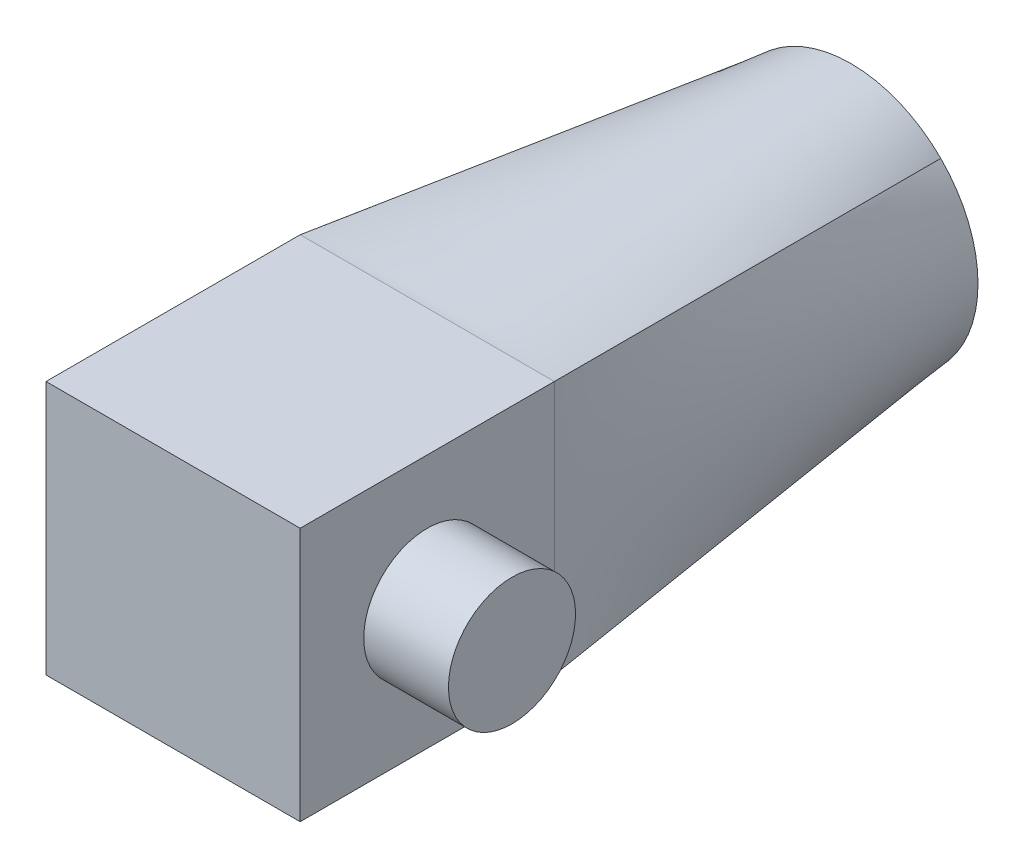
ISO-10303-21;
HEADER;
FILE_DESCRIPTION(('STEP AP214'),'2;1');
FILE_NAME('part.step','',(''),(''),'','','');
FILE_SCHEMA(('AUTOMOTIVE_DESIGN { 1 0 10303 214 1 1 1 1 }'));
ENDSEC;
DATA;
#1=APPLICATION_CONTEXT('core data for automotive mechanical design processes');
#2=APPLICATION_PROTOCOL_DEFINITION('international standard','automotive_design',2000,#1);
#3=PRODUCT_CONTEXT('',#1,'mechanical');
#4=PRODUCT('Part','Part','',(#3));
#5=PRODUCT_RELATED_PRODUCT_CATEGORY('part','',(#4));
#6=PRODUCT_DEFINITION_FORMATION('','',#4);
#7=PRODUCT_DEFINITION_CONTEXT('part definition',#1,'design');
#8=PRODUCT_DEFINITION('design','',#6,#7);
#9=PRODUCT_DEFINITION_SHAPE('','',#8);
#10=(LENGTH_UNIT() NAMED_UNIT(*) SI_UNIT(.MILLI.,.METRE.));
#11=(NAMED_UNIT(*) PLANE_ANGLE_UNIT() SI_UNIT($,.RADIAN.));
#12=(NAMED_UNIT(*) SI_UNIT($,.STERADIAN.) SOLID_ANGLE_UNIT());
#13=UNCERTAINTY_MEASURE_WITH_UNIT(LENGTH_MEASURE(1.E-05),#10,'distance_accuracy_value','');
#14=(GEOMETRIC_REPRESENTATION_CONTEXT(3) GLOBAL_UNCERTAINTY_ASSIGNED_CONTEXT((#13)) GLOBAL_UNIT_ASSIGNED_CONTEXT((#10,
#11,#12)) REPRESENTATION_CONTEXT('',''));
#15=CARTESIAN_POINT('',(0.,0.,0.));
#16=DIRECTION('',(0.,0.,1.));
#17=DIRECTION('',(1.,0.,0.));
#18=AXIS2_PLACEMENT_3D('',#15,#16,#17);
#19=CARTESIAN_POINT('',(0.,0.,0.));
#20=DIRECTION('',(0.,0.,1.));
#21=DIRECTION('',(1.,0.,0.));
#22=AXIS2_PLACEMENT_3D('',#19,#20,#21);
#23=PLANE('',#22);
#24=CARTESIAN_POINT('',(0.,0.,0.));
#25=DIRECTION('',(0.,0.,1.));
#26=DIRECTION('',(1.,0.,0.));
#27=AXIS2_PLACEMENT_3D('',#24,#25,#26);
#28=CIRCLE('',#27,0.75);
#29=CARTESIAN_POINT('',(0.75,0.,0.));
#30=VERTEX_POINT('',#29);
#31=EDGE_CURVE('E159',#30,#30,#28,.T.);
#32=ORIENTED_EDGE('',*,*,#31,.T.);
#33=EDGE_LOOP('',(#32));
#34=FACE_BOUND('',#33,.T.);
#35=CARTESIAN_POINT('',(0.,0.,0.));
#36=DIRECTION('',(0.,0.,1.));
#37=DIRECTION('',(1.,0.,0.));
#38=AXIS2_PLACEMENT_3D('',#35,#36,#37);
#39=CIRCLE('',#38,1.5);
#40=CARTESIAN_POINT('',(-1.06066017177982,1.06066017177982,0.));
#41=VERTEX_POINT('',#40);
#42=CARTESIAN_POINT('',(-1.06066017177982,-1.06066017177982,0.));
#43=VERTEX_POINT('',#42);
#44=EDGE_CURVE('E247',#41,#43,#39,.T.);
#45=ORIENTED_EDGE('',*,*,#44,.F.);
#46=CARTESIAN_POINT('',(1.06066017177982,1.06066017177982,0.));
#47=VERTEX_POINT('',#46);
#48=EDGE_CURVE('E237',#47,#41,#39,.T.);
#49=ORIENTED_EDGE('',*,*,#48,.F.);
#50=CARTESIAN_POINT('',(1.06066017177982,-1.06066017177982,0.));
#51=VERTEX_POINT('',#50);
#52=EDGE_CURVE('E227',#51,#47,#39,.T.);
#53=ORIENTED_EDGE('',*,*,#52,.F.);
#54=EDGE_CURVE('E236',#43,#51,#39,.T.);
#55=ORIENTED_EDGE('',*,*,#54,.F.);
#56=EDGE_LOOP('',(#45,#49,#53,#55));
#57=FACE_BOUND('',#56,.T.);
#58=ADVANCED_FACE('F69',(#34,#57),#23,.F.);
#59=CARTESIAN_POINT('',(1.06066017177982,-1.06066017177982,0.));
#60=CARTESIAN_POINT('',(1.5,-1.5,5.));
#61=CARTESIAN_POINT('',(1.18566017177982,-0.935660171779822,0.));
#62=CARTESIAN_POINT('',(1.5,-1.25,5.));
#63=CARTESIAN_POINT('',(1.29773789431569,-0.778019163644887,0.));
#64=CARTESIAN_POINT('',(1.5,-0.999999999999999,5.));
#65=CARTESIAN_POINT('',(1.45548773968208,-0.413512878852326,0.));
#66=CARTESIAN_POINT('',(1.5,-0.499999999999999,5.));
#67=CARTESIAN_POINT('',(1.5,-0.207106781186548,0.));
#68=CARTESIAN_POINT('',(1.5,-0.249999999999999,5.));
#69=CARTESIAN_POINT('',(1.5,0.207106781186547,0.));
#70=CARTESIAN_POINT('',(1.5,0.250000000000001,5.));
#71=CARTESIAN_POINT('',(1.45548773968208,0.413512878852326,0.));
#72=CARTESIAN_POINT('',(1.5,0.500000000000001,5.));
#73=CARTESIAN_POINT('',(1.29773789431569,0.778019163644886,0.));
#74=CARTESIAN_POINT('',(1.5,1.,5.));
#75=CARTESIAN_POINT('',(1.18566017177982,0.935660171779822,0.));
#76=CARTESIAN_POINT('',(1.5,1.25,5.));
#77=CARTESIAN_POINT('',(1.06066017177982,1.06066017177982,0.));
#78=CARTESIAN_POINT('',(1.5,1.5,5.));
#79=B_SPLINE_SURFACE_WITH_KNOTS('',3,1,((#59,#60),(#61,#62),(#63,#64),(#65,#66),(#67,#68),(#69,
#70),(#71,#72),(#73,#74),(#75,#76),(#77,#78)),.UNSPECIFIED.,.F.,.F.,.F.,(4,2,2,2,4),(2,2),(0.,
0.25,0.5,0.75,1.),(0.,1.),.UNSPECIFIED.);
#80=DIRECTION('',(0.0871973134841828,0.0871973134841832,0.992367501000654));
#81=VECTOR('',#80,1.);
#82=CARTESIAN_POINT('',(1.28033008588991,1.28033008588991,2.5));
#83=LINE('',#82,#81);
#84=CARTESIAN_POINT('',(1.5,1.5,5.));
#85=VERTEX_POINT('',#84);
#86=EDGE_CURVE('E88',#47,#85,#83,.T.);
#87=DIRECTION('',(0.,1.,0.));
#88=VECTOR('',#87,1.);
#89=CARTESIAN_POINT('',(1.5,1.5,5.));
#90=LINE('',#89,#88);
#91=CARTESIAN_POINT('',(1.5,-1.5,5.));
#92=VERTEX_POINT('',#91);
#93=EDGE_CURVE('E156',#92,#85,#90,.T.);
#94=DIRECTION('',(-0.087197313484183,0.0871973134841828,-0.992367501000654));
#95=VECTOR('',#94,1.);
#96=CARTESIAN_POINT('',(1.28033008588991,-1.28033008588991,2.5));
#97=LINE('',#96,#95);
#98=EDGE_CURVE('E255',#92,#51,#97,.T.);
#99=ORIENTED_EDGE('',*,*,#52,.T.);
#100=ORIENTED_EDGE('',*,*,#86,.T.);
#101=ORIENTED_EDGE('',*,*,#93,.F.);
#102=ORIENTED_EDGE('',*,*,#98,.T.);
#103=EDGE_LOOP('',(#99,#100,#101,#102));
#104=FACE_BOUND('',#103,.T.);
#105=ADVANCED_FACE('F201',(#104),#79,.T.);
#106=CARTESIAN_POINT('',(1.06066017177982,1.06066017177982,0.));
#107=CARTESIAN_POINT('',(1.5,1.5,5.));
#108=CARTESIAN_POINT('',(0.935660171779821,1.18566017177982,0.));
#109=CARTESIAN_POINT('',(1.25,1.5,5.));
#110=CARTESIAN_POINT('',(0.778019163644887,1.29773789431569,0.));
#111=CARTESIAN_POINT('',(0.999999999999999,1.5,5.));
#112=CARTESIAN_POINT('',(0.413512878852326,1.45548773968208,0.));
#113=CARTESIAN_POINT('',(0.499999999999999,1.5,5.));
#114=CARTESIAN_POINT('',(0.207106781186548,1.5,0.));
#115=CARTESIAN_POINT('',(0.249999999999999,1.5,5.));
#116=CARTESIAN_POINT('',(-0.207106781186548,1.5,0.));
#117=CARTESIAN_POINT('',(-0.250000000000001,1.5,5.));
#118=CARTESIAN_POINT('',(-0.413512878852326,1.45548773968208,0.));
#119=CARTESIAN_POINT('',(-0.500000000000001,1.5,5.));
#120=CARTESIAN_POINT('',(-0.778019163644887,1.29773789431569,0.));
#121=CARTESIAN_POINT('',(-1.,1.5,5.));
#122=CARTESIAN_POINT('',(-0.935660171779821,1.18566017177982,0.));
#123=CARTESIAN_POINT('',(-1.25,1.5,5.));
#124=CARTESIAN_POINT('',(-1.06066017177982,1.06066017177982,0.));
#125=CARTESIAN_POINT('',(-1.5,1.5,5.));
#126=B_SPLINE_SURFACE_WITH_KNOTS('',3,1,((#106,#107),(#108,#109),(#110,#111),(#112,#113),(#114,
#115),(#116,#117),(#118,#119),(#120,#121),(#122,#123),(#124,#125)),.UNSPECIFIED.,.F.,.F.,.F.,(4,
2,2,2,4),(2,2),(0.,0.25,0.5,0.75,1.),(0.,1.),.UNSPECIFIED.);
#127=DIRECTION('',(-0.0871973134841832,0.0871973134841832,0.992367501000654));
#128=VECTOR('',#127,1.);
#129=CARTESIAN_POINT('',(-1.28033008588991,1.28033008588991,2.5));
#130=LINE('',#129,#128);
#131=CARTESIAN_POINT('',(-1.5,1.5,5.));
#132=VERTEX_POINT('',#131);
#133=EDGE_CURVE('E259',#41,#132,#130,.T.);
#134=DIRECTION('',(-1.,0.,0.));
#135=VECTOR('',#134,1.);
#136=CARTESIAN_POINT('',(-1.5,1.5,5.));
#137=LINE('',#136,#135);
#138=EDGE_CURVE('E81',#85,#132,#137,.T.);
#139=ORIENTED_EDGE('',*,*,#48,.T.);
#140=ORIENTED_EDGE('',*,*,#133,.T.);
#141=ORIENTED_EDGE('',*,*,#138,.F.);
#142=ORIENTED_EDGE('',*,*,#86,.F.);
#143=EDGE_LOOP('',(#139,#140,#141,#142));
#144=FACE_BOUND('',#143,.T.);
#145=ADVANCED_FACE('F292',(#144),#126,.T.);
#146=CARTESIAN_POINT('',(-1.06066017177982,-1.06066017177982,0.));
#147=CARTESIAN_POINT('',(-1.5,-1.5,5.));
#148=CARTESIAN_POINT('',(-0.935660171779822,-1.18566017177982,0.));
#149=CARTESIAN_POINT('',(-1.25,-1.5,5.));
#150=CARTESIAN_POINT('',(-0.778019163644887,-1.29773789431569,0.));
#151=CARTESIAN_POINT('',(-1.,-1.5,5.));
#152=CARTESIAN_POINT('',(-0.413512878852326,-1.45548773968208,0.));
#153=CARTESIAN_POINT('',(-0.5,-1.5,5.));
#154=CARTESIAN_POINT('',(-0.207106781186548,-1.5,0.));
#155=CARTESIAN_POINT('',(-0.25,-1.5,5.));
#156=CARTESIAN_POINT('',(0.207106781186547,-1.5,0.));
#157=CARTESIAN_POINT('',(0.25,-1.5,5.));
#158=CARTESIAN_POINT('',(0.413512878852326,-1.45548773968208,0.));
#159=CARTESIAN_POINT('',(0.5,-1.5,5.));
#160=CARTESIAN_POINT('',(0.778019163644886,-1.29773789431569,0.));
#161=CARTESIAN_POINT('',(1.,-1.5,5.));
#162=CARTESIAN_POINT('',(0.935660171779821,-1.18566017177982,0.));
#163=CARTESIAN_POINT('',(1.25,-1.5,5.));
#164=CARTESIAN_POINT('',(1.06066017177982,-1.06066017177982,0.));
#165=CARTESIAN_POINT('',(1.5,-1.5,5.));
#166=B_SPLINE_SURFACE_WITH_KNOTS('',3,1,((#146,#147),(#148,#149),(#150,#151),(#152,#153),(#154,
#155),(#156,#157),(#158,#159),(#160,#161),(#162,#163),(#164,#165)),.UNSPECIFIED.,.F.,.F.,.F.,(4,
2,2,2,4),(2,2),(0.,0.25,0.5,0.75,1.),(0.,1.),.UNSPECIFIED.);
#167=DIRECTION('',(1.,0.,0.));
#168=VECTOR('',#167,1.);
#169=CARTESIAN_POINT('',(-1.5,-1.5,5.));
#170=LINE('',#169,#168);
#171=CARTESIAN_POINT('',(-1.5,-1.5,5.));
#172=VERTEX_POINT('',#171);
#173=EDGE_CURVE('E340',#172,#92,#170,.T.);
#174=DIRECTION('',(-0.0871973134841831,-0.0871973134841829,0.992367501000654));
#175=VECTOR('',#174,1.);
#176=CARTESIAN_POINT('',(-1.28033008588991,-1.28033008588991,2.5));
#177=LINE('',#176,#175);
#178=EDGE_CURVE('E327',#43,#172,#177,.T.);
#179=ORIENTED_EDGE('',*,*,#54,.T.);
#180=ORIENTED_EDGE('',*,*,#98,.F.);
#181=ORIENTED_EDGE('',*,*,#173,.F.);
#182=ORIENTED_EDGE('',*,*,#178,.F.);
#183=EDGE_LOOP('',(#179,#180,#181,#182));
#184=FACE_BOUND('',#183,.T.);
#185=ADVANCED_FACE('F282',(#184),#166,.T.);
#186=CARTESIAN_POINT('',(-1.06066017177982,1.06066017177982,0.));
#187=CARTESIAN_POINT('',(-1.5,1.5,5.));
#188=CARTESIAN_POINT('',(-1.18566017177982,0.935660171779821,0.));
#189=CARTESIAN_POINT('',(-1.5,1.25,5.));
#190=CARTESIAN_POINT('',(-1.29773789431569,0.778019163644887,0.));
#191=CARTESIAN_POINT('',(-1.5,1.,5.));
#192=CARTESIAN_POINT('',(-1.45548773968208,0.413512878852326,0.));
#193=CARTESIAN_POINT('',(-1.5,0.500000000000001,5.));
#194=CARTESIAN_POINT('',(-1.5,0.207106781186548,0.));
#195=CARTESIAN_POINT('',(-1.5,0.250000000000001,5.));
#196=CARTESIAN_POINT('',(-1.5,-0.207106781186548,0.));
#197=CARTESIAN_POINT('',(-1.5,-0.249999999999999,5.));
#198=CARTESIAN_POINT('',(-1.45548773968208,-0.413512878852326,0.));
#199=CARTESIAN_POINT('',(-1.5,-0.499999999999999,5.));
#200=CARTESIAN_POINT('',(-1.29773789431569,-0.778019163644887,0.));
#201=CARTESIAN_POINT('',(-1.5,-0.999999999999999,5.));
#202=CARTESIAN_POINT('',(-1.18566017177982,-0.935660171779821,0.));
#203=CARTESIAN_POINT('',(-1.5,-1.25,5.));
#204=CARTESIAN_POINT('',(-1.06066017177982,-1.06066017177982,0.));
#205=CARTESIAN_POINT('',(-1.5,-1.5,5.));
#206=B_SPLINE_SURFACE_WITH_KNOTS('',3,1,((#186,#187),(#188,#189),(#190,#191),(#192,#193),(#194,
#195),(#196,#197),(#198,#199),(#200,#201),(#202,#203),(#204,#205)),.UNSPECIFIED.,.F.,.F.,.F.,(4,
2,2,2,4),(2,2),(0.,0.25,0.5,0.75,1.),(0.,1.),.UNSPECIFIED.);
#207=DIRECTION('',(0.,-1.,0.));
#208=VECTOR('',#207,1.);
#209=CARTESIAN_POINT('',(-1.5,1.5,5.));
#210=LINE('',#209,#208);
#211=EDGE_CURVE('E96',#132,#172,#210,.T.);
#212=ORIENTED_EDGE('',*,*,#44,.T.);
#213=ORIENTED_EDGE('',*,*,#178,.T.);
#214=ORIENTED_EDGE('',*,*,#211,.F.);
#215=ORIENTED_EDGE('',*,*,#133,.F.);
#216=EDGE_LOOP('',(#212,#213,#214,#215));
#217=FACE_BOUND('',#216,.T.);
#218=ADVANCED_FACE('F71',(#217),#206,.T.);
#219=CARTESIAN_POINT('',(0.,0.,3.));
#220=DIRECTION('',(0.,0.,-1.));
#221=DIRECTION('',(-1.,0.,0.));
#222=AXIS2_PLACEMENT_3D('',#219,#220,#221);
#223=CYLINDRICAL_SURFACE('',#222,0.75);
#224=CARTESIAN_POINT('',(0.,0.,3.));
#225=DIRECTION('',(0.,0.,1.));
#226=DIRECTION('',(1.,0.,0.));
#227=AXIS2_PLACEMENT_3D('',#224,#225,#226);
#228=CIRCLE('',#227,0.75);
#229=CARTESIAN_POINT('',(0.75,0.,3.));
#230=VERTEX_POINT('',#229);
#231=EDGE_CURVE('E164',#230,#230,#228,.T.);
#232=ORIENTED_EDGE('',*,*,#231,.T.);
#233=EDGE_LOOP('',(#232));
#234=FACE_BOUND('',#233,.T.);
#235=ORIENTED_EDGE('',*,*,#31,.F.);
#236=EDGE_LOOP('',(#235));
#237=FACE_BOUND('',#236,.T.);
#238=ADVANCED_FACE('F193',(#234,#237),#223,.F.);
#239=CARTESIAN_POINT('',(0.,0.,3.));
#240=DIRECTION('',(0.,0.,1.));
#241=DIRECTION('',(1.,0.,0.));
#242=AXIS2_PLACEMENT_3D('',#239,#240,#241);
#243=PLANE('',#242);
#244=ORIENTED_EDGE('',*,*,#231,.F.);
#245=EDGE_LOOP('',(#244));
#246=FACE_BOUND('',#245,.T.);
#247=ADVANCED_FACE('F187',(#246),#243,.F.);
#248=CARTESIAN_POINT('',(1.5,1.5,8.));
#249=DIRECTION('',(-1.,0.,0.));
#250=DIRECTION('',(0.,-1.,0.));
#251=AXIS2_PLACEMENT_3D('',#248,#249,#250);
#252=PLANE('',#251);
#253=CARTESIAN_POINT('',(1.5,0.,6.5));
#254=DIRECTION('',(-1.,0.,0.));
#255=DIRECTION('',(0.,-1.,0.));
#256=AXIS2_PLACEMENT_3D('',#253,#254,#255);
#257=CIRCLE('',#256,0.75);
#258=CARTESIAN_POINT('',(1.5,-0.749999999999999,6.5));
#259=VERTEX_POINT('',#258);
#260=EDGE_CURVE('E12',#259,#259,#257,.F.);
#261=ORIENTED_EDGE('',*,*,#260,.F.);
#262=EDGE_LOOP('',(#261));
#263=FACE_BOUND('',#262,.T.);
#264=ORIENTED_EDGE('',*,*,#93,.T.);
#265=DIRECTION('',(0.,0.,-1.));
#266=VECTOR('',#265,1.);
#267=CARTESIAN_POINT('',(1.5,1.5,8.));
#268=LINE('',#267,#266);
#269=CARTESIAN_POINT('',(1.5,1.5,8.));
#270=VERTEX_POINT('',#269);
#271=EDGE_CURVE('E135',#270,#85,#268,.T.);
#272=ORIENTED_EDGE('',*,*,#271,.F.);
#273=DIRECTION('',(0.,1.,0.));
#274=VECTOR('',#273,1.);
#275=CARTESIAN_POINT('',(1.5,1.5,8.));
#276=LINE('',#275,#274);
#277=CARTESIAN_POINT('',(1.5,-1.5,8.));
#278=VERTEX_POINT('',#277);
#279=EDGE_CURVE('E143',#278,#270,#276,.T.);
#280=ORIENTED_EDGE('',*,*,#279,.F.);
#281=DIRECTION('',(0.,0.,-1.));
#282=VECTOR('',#281,1.);
#283=CARTESIAN_POINT('',(1.5,-1.5,8.));
#284=LINE('',#283,#282);
#285=EDGE_CURVE('E358',#278,#92,#284,.T.);
#286=ORIENTED_EDGE('',*,*,#285,.T.);
#287=EDGE_LOOP('',(#264,#272,#280,#286));
#288=FACE_BOUND('',#287,.T.);
#289=ADVANCED_FACE('F155',(#263,#288),#252,.F.);
#290=CARTESIAN_POINT('',(-1.5,1.5,8.));
#291=DIRECTION('',(0.,-1.,0.));
#292=DIRECTION('',(0.,0.,-1.));
#293=AXIS2_PLACEMENT_3D('',#290,#291,#292);
#294=PLANE('',#293);
#295=ORIENTED_EDGE('',*,*,#138,.T.);
#296=DIRECTION('',(0.,0.,-1.));
#297=VECTOR('',#296,1.);
#298=CARTESIAN_POINT('',(-1.5,1.5,8.));
#299=LINE('',#298,#297);
#300=CARTESIAN_POINT('',(-1.5,1.5,8.));
#301=VERTEX_POINT('',#300);
#302=EDGE_CURVE('E138',#301,#132,#299,.T.);
#303=ORIENTED_EDGE('',*,*,#302,.F.);
#304=DIRECTION('',(-1.,0.,0.));
#305=VECTOR('',#304,1.);
#306=CARTESIAN_POINT('',(-1.5,1.5,8.));
#307=LINE('',#306,#305);
#308=EDGE_CURVE('E130',#270,#301,#307,.T.);
#309=ORIENTED_EDGE('',*,*,#308,.F.);
#310=ORIENTED_EDGE('',*,*,#271,.T.);
#311=EDGE_LOOP('',(#295,#303,#309,#310));
#312=FACE_BOUND('',#311,.T.);
#313=ADVANCED_FACE('F133',(#312),#294,.F.);
#314=CARTESIAN_POINT('',(-1.5,1.5,8.));
#315=DIRECTION('',(1.,0.,0.));
#316=DIRECTION('',(0.,1.,0.));
#317=AXIS2_PLACEMENT_3D('',#314,#315,#316);
#318=PLANE('',#317);
#319=ORIENTED_EDGE('',*,*,#211,.T.);
#320=DIRECTION('',(0.,0.,-1.));
#321=VECTOR('',#320,1.);
#322=CARTESIAN_POINT('',(-1.5,-1.5,8.));
#323=LINE('',#322,#321);
#324=CARTESIAN_POINT('',(-1.5,-1.5,8.));
#325=VERTEX_POINT('',#324);
#326=EDGE_CURVE('E166',#325,#172,#323,.T.);
#327=ORIENTED_EDGE('',*,*,#326,.F.);
#328=DIRECTION('',(0.,-1.,0.));
#329=VECTOR('',#328,1.);
#330=CARTESIAN_POINT('',(-1.5,1.5,8.));
#331=LINE('',#330,#329);
#332=EDGE_CURVE('E142',#301,#325,#331,.T.);
#333=ORIENTED_EDGE('',*,*,#332,.F.);
#334=ORIENTED_EDGE('',*,*,#302,.T.);
#335=EDGE_LOOP('',(#319,#327,#333,#334));
#336=FACE_BOUND('',#335,.T.);
#337=ADVANCED_FACE('F401',(#336),#318,.F.);
#338=CARTESIAN_POINT('',(-1.5,-1.5,8.));
#339=DIRECTION('',(0.,1.,0.));
#340=DIRECTION('',(0.,0.,1.));
#341=AXIS2_PLACEMENT_3D('',#338,#339,#340);
#342=PLANE('',#341);
#343=ORIENTED_EDGE('',*,*,#173,.T.);
#344=ORIENTED_EDGE('',*,*,#285,.F.);
#345=DIRECTION('',(1.,0.,0.));
#346=VECTOR('',#345,1.);
#347=CARTESIAN_POINT('',(-1.5,-1.5,8.));
#348=LINE('',#347,#346);
#349=EDGE_CURVE('E148',#325,#278,#348,.T.);
#350=ORIENTED_EDGE('',*,*,#349,.F.);
#351=ORIENTED_EDGE('',*,*,#326,.T.);
#352=EDGE_LOOP('',(#343,#344,#350,#351));
#353=FACE_BOUND('',#352,.T.);
#354=ADVANCED_FACE('F397',(#353),#342,.F.);
#355=CARTESIAN_POINT('',(0.,0.,8.));
#356=DIRECTION('',(0.,0.,1.));
#357=DIRECTION('',(1.,0.,0.));
#358=AXIS2_PLACEMENT_3D('',#355,#356,#357);
#359=PLANE('',#358);
#360=ORIENTED_EDGE('',*,*,#279,.T.);
#361=ORIENTED_EDGE('',*,*,#308,.T.);
#362=ORIENTED_EDGE('',*,*,#332,.T.);
#363=ORIENTED_EDGE('',*,*,#349,.T.);
#364=EDGE_LOOP('',(#360,#361,#362,#363));
#365=FACE_BOUND('',#364,.T.);
#366=ADVANCED_FACE('F146',(#365),#359,.T.);
#367=CARTESIAN_POINT('',(2.5,0.,6.5));
#368=DIRECTION('',(-1.,0.,0.));
#369=DIRECTION('',(0.,-1.,0.));
#370=AXIS2_PLACEMENT_3D('',#367,#368,#369);
#371=CYLINDRICAL_SURFACE('',#370,0.75);
#372=CARTESIAN_POINT('',(2.5,0.,6.5));
#373=DIRECTION('',(1.,0.,0.));
#374=DIRECTION('',(0.,1.,0.));
#375=AXIS2_PLACEMENT_3D('',#372,#373,#374);
#376=CIRCLE('',#375,0.75);
#377=CARTESIAN_POINT('',(2.5,0.750000000000001,6.5));
#378=VERTEX_POINT('',#377);
#379=EDGE_CURVE('E153',#378,#378,#376,.T.);
#380=ORIENTED_EDGE('',*,*,#379,.F.);
#381=EDGE_LOOP('',(#380));
#382=FACE_BOUND('',#381,.T.);
#383=ORIENTED_EDGE('',*,*,#260,.T.);
#384=EDGE_LOOP('',(#383));
#385=FACE_BOUND('',#384,.T.);
#386=ADVANCED_FACE('F387',(#382,#385),#371,.T.);
#387=CARTESIAN_POINT('',(2.5,0.,6.5));
#388=DIRECTION('',(1.,0.,0.));
#389=DIRECTION('',(0.,1.,0.));
#390=AXIS2_PLACEMENT_3D('',#387,#388,#389);
#391=PLANE('',#390);
#392=ORIENTED_EDGE('',*,*,#379,.T.);
#393=EDGE_LOOP('',(#392));
#394=FACE_BOUND('',#393,.T.);
#395=ADVANCED_FACE('F385',(#394),#391,.T.);
#396=CLOSED_SHELL('',(#58,#105,#145,#185,#218,#238,#247,#289,#313,#337,#354,#366,#386,#395));
#397=MANIFOLD_SOLID_BREP('B2',#396);
#398=ADVANCED_BREP_SHAPE_REPRESENTATION('',(#18,#397),#14);
#399=SHAPE_DEFINITION_REPRESENTATION(#9,#398);
ENDSEC;
END-ISO-10303-21;
